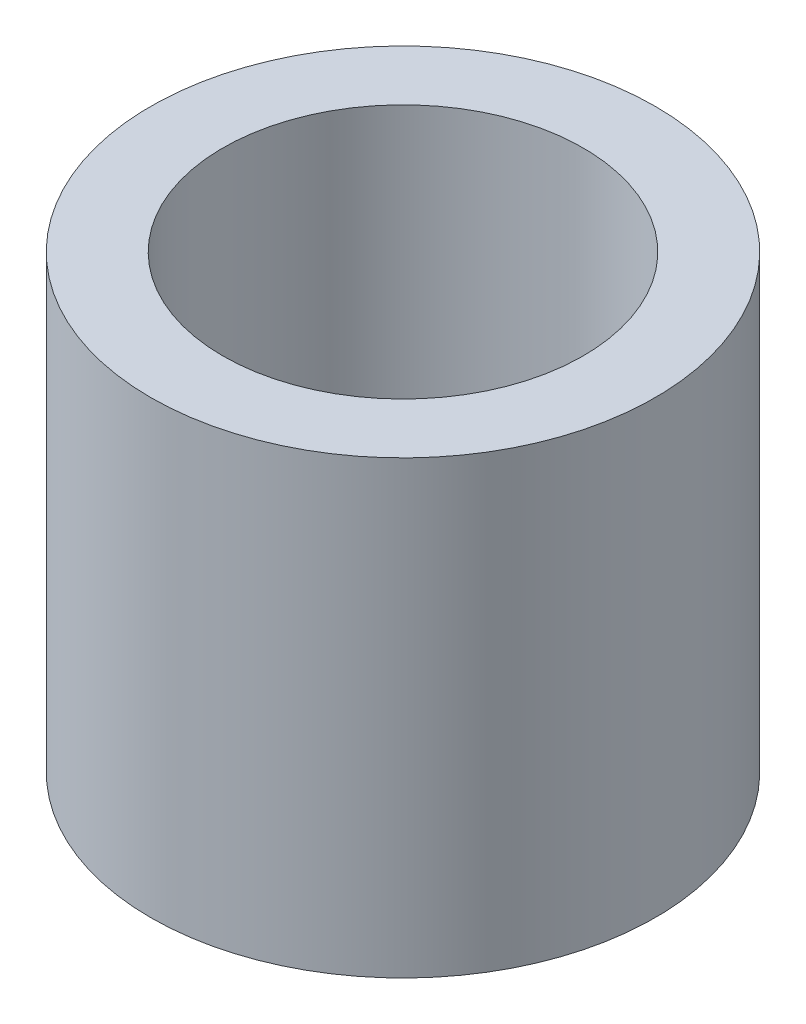
ISO-10303-21;
HEADER;
FILE_DESCRIPTION(('STEP AP214'),'2;1');
FILE_NAME('part.step','',(''),(''),'','','');
FILE_SCHEMA(('AUTOMOTIVE_DESIGN { 1 0 10303 214 1 1 1 1 }'));
ENDSEC;
DATA;
#1=APPLICATION_CONTEXT('core data for automotive mechanical design processes');
#2=APPLICATION_PROTOCOL_DEFINITION('international standard','automotive_design',2000,#1);
#3=PRODUCT_CONTEXT('',#1,'mechanical');
#4=PRODUCT('Part','Part','',(#3));
#5=PRODUCT_RELATED_PRODUCT_CATEGORY('part','',(#4));
#6=PRODUCT_DEFINITION_FORMATION('','',#4);
#7=PRODUCT_DEFINITION_CONTEXT('part definition',#1,'design');
#8=PRODUCT_DEFINITION('design','',#6,#7);
#9=PRODUCT_DEFINITION_SHAPE('','',#8);
#10=(LENGTH_UNIT() NAMED_UNIT(*) SI_UNIT(.MILLI.,.METRE.));
#11=(NAMED_UNIT(*) PLANE_ANGLE_UNIT() SI_UNIT($,.RADIAN.));
#12=(NAMED_UNIT(*) SI_UNIT($,.STERADIAN.) SOLID_ANGLE_UNIT());
#13=UNCERTAINTY_MEASURE_WITH_UNIT(LENGTH_MEASURE(1.E-05),#10,'distance_accuracy_value','');
#14=(GEOMETRIC_REPRESENTATION_CONTEXT(3) GLOBAL_UNCERTAINTY_ASSIGNED_CONTEXT((#13)) GLOBAL_UNIT_ASSIGNED_CONTEXT((#10,
#11,#12)) REPRESENTATION_CONTEXT('',''));
#15=CARTESIAN_POINT('',(0.,0.,0.));
#16=DIRECTION('',(0.,0.,1.));
#17=DIRECTION('',(1.,0.,0.));
#18=AXIS2_PLACEMENT_3D('',#15,#16,#17);
#19=CARTESIAN_POINT('',(0.,2.5,0.));
#20=DIRECTION('',(0.,1.,0.));
#21=DIRECTION('',(0.,0.,1.));
#22=AXIS2_PLACEMENT_3D('',#19,#20,#21);
#23=PLANE('',#22);
#24=CARTESIAN_POINT('',(0.,2.5,0.));
#25=DIRECTION('',(0.,1.,0.));
#26=DIRECTION('',(0.,0.,1.));
#27=AXIS2_PLACEMENT_3D('',#24,#25,#26);
#28=CIRCLE('',#27,1.4);
#29=CARTESIAN_POINT('',(0.,2.5,1.4));
#30=VERTEX_POINT('',#29);
#31=EDGE_CURVE('E10',#30,#30,#28,.T.);
#32=ORIENTED_EDGE('',*,*,#31,.T.);
#33=EDGE_LOOP('',(#32));
#34=FACE_BOUND('',#33,.T.);
#35=CARTESIAN_POINT('',(0.,2.5,0.));
#36=DIRECTION('',(0.,1.,0.));
#37=DIRECTION('',(0.,0.,1.));
#38=AXIS2_PLACEMENT_3D('',#35,#36,#37);
#39=CIRCLE('',#38,1.);
#40=CARTESIAN_POINT('',(0.,2.5,1.));
#41=VERTEX_POINT('',#40);
#42=EDGE_CURVE('E45',#41,#41,#39,.T.);
#43=ORIENTED_EDGE('',*,*,#42,.F.);
#44=EDGE_LOOP('',(#43));
#45=FACE_BOUND('',#44,.T.);
#46=ADVANCED_FACE('F34',(#34,#45),#23,.T.);
#47=CARTESIAN_POINT('',(0.,0.,0.));
#48=DIRECTION('',(0.,1.,0.));
#49=DIRECTION('',(0.,0.,1.));
#50=AXIS2_PLACEMENT_3D('',#47,#48,#49);
#51=PLANE('',#50);
#52=CARTESIAN_POINT('',(0.,0.,0.));
#53=DIRECTION('',(0.,1.,0.));
#54=DIRECTION('',(0.,0.,1.));
#55=AXIS2_PLACEMENT_3D('',#52,#53,#54);
#56=CIRCLE('',#55,1.4);
#57=CARTESIAN_POINT('',(0.,0.,1.4));
#58=VERTEX_POINT('',#57);
#59=EDGE_CURVE('E38',#58,#58,#56,.T.);
#60=ORIENTED_EDGE('',*,*,#59,.F.);
#61=EDGE_LOOP('',(#60));
#62=FACE_BOUND('',#61,.T.);
#63=CARTESIAN_POINT('',(0.,0.,0.));
#64=DIRECTION('',(0.,1.,0.));
#65=DIRECTION('',(0.,0.,1.));
#66=AXIS2_PLACEMENT_3D('',#63,#64,#65);
#67=CIRCLE('',#66,1.);
#68=CARTESIAN_POINT('',(0.,0.,1.));
#69=VERTEX_POINT('',#68);
#70=EDGE_CURVE('E47',#69,#69,#67,.T.);
#71=ORIENTED_EDGE('',*,*,#70,.T.);
#72=EDGE_LOOP('',(#71));
#73=FACE_BOUND('',#72,.T.);
#74=ADVANCED_FACE('F57',(#62,#73),#51,.F.);
#75=CARTESIAN_POINT('',(0.,2.5,0.));
#76=DIRECTION('',(0.,-1.,0.));
#77=DIRECTION('',(0.,0.,-1.));
#78=AXIS2_PLACEMENT_3D('',#75,#76,#77);
#79=CYLINDRICAL_SURFACE('',#78,1.4);
#80=ORIENTED_EDGE('',*,*,#31,.F.);
#81=EDGE_LOOP('',(#80));
#82=FACE_BOUND('',#81,.T.);
#83=ORIENTED_EDGE('',*,*,#59,.T.);
#84=EDGE_LOOP('',(#83));
#85=FACE_BOUND('',#84,.T.);
#86=ADVANCED_FACE('F36',(#82,#85),#79,.T.);
#87=CARTESIAN_POINT('',(0.,2.5,0.));
#88=DIRECTION('',(0.,-1.,0.));
#89=DIRECTION('',(0.,0.,-1.));
#90=AXIS2_PLACEMENT_3D('',#87,#88,#89);
#91=CYLINDRICAL_SURFACE('',#90,1.);
#92=ORIENTED_EDGE('',*,*,#42,.T.);
#93=EDGE_LOOP('',(#92));
#94=FACE_BOUND('',#93,.T.);
#95=ORIENTED_EDGE('',*,*,#70,.F.);
#96=EDGE_LOOP('',(#95));
#97=FACE_BOUND('',#96,.T.);
#98=ADVANCED_FACE('F53',(#94,#97),#91,.F.);
#99=CLOSED_SHELL('',(#46,#74,#86,#98));
#100=MANIFOLD_SOLID_BREP('B2',#99);
#101=ADVANCED_BREP_SHAPE_REPRESENTATION('',(#18,#100),#14);
#102=SHAPE_DEFINITION_REPRESENTATION(#9,#101);
ENDSEC;
END-ISO-10303-21;
